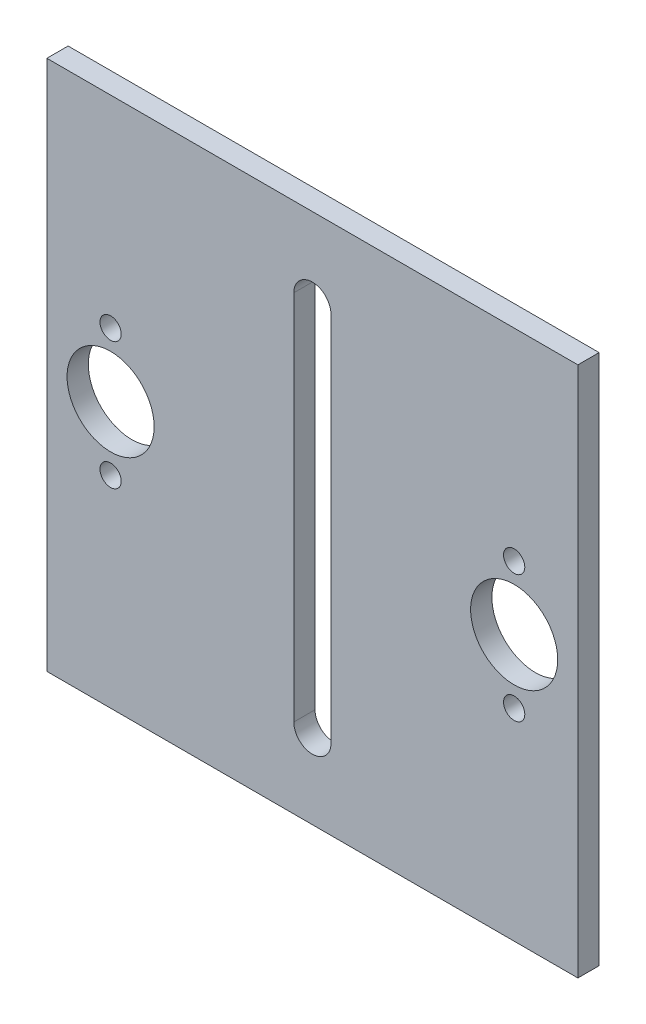
ISO-10303-21;
HEADER;
FILE_DESCRIPTION(('STEP AP214'),'2;1');
FILE_NAME('part.step','',(''),(''),'','','');
FILE_SCHEMA(('AUTOMOTIVE_DESIGN { 1 0 10303 214 1 1 1 1 }'));
ENDSEC;
DATA;
#1=APPLICATION_CONTEXT('core data for automotive mechanical design processes');
#2=APPLICATION_PROTOCOL_DEFINITION('international standard','automotive_design',2000,#1);
#3=PRODUCT_CONTEXT('',#1,'mechanical');
#4=PRODUCT('Part','Part','',(#3));
#5=PRODUCT_RELATED_PRODUCT_CATEGORY('part','',(#4));
#6=PRODUCT_DEFINITION_FORMATION('','',#4);
#7=PRODUCT_DEFINITION_CONTEXT('part definition',#1,'design');
#8=PRODUCT_DEFINITION('design','',#6,#7);
#9=PRODUCT_DEFINITION_SHAPE('','',#8);
#10=(LENGTH_UNIT() NAMED_UNIT(*) SI_UNIT(.MILLI.,.METRE.));
#11=(NAMED_UNIT(*) PLANE_ANGLE_UNIT() SI_UNIT($,.RADIAN.));
#12=(NAMED_UNIT(*) SI_UNIT($,.STERADIAN.) SOLID_ANGLE_UNIT());
#13=UNCERTAINTY_MEASURE_WITH_UNIT(LENGTH_MEASURE(1.E-05),#10,'distance_accuracy_value','');
#14=(GEOMETRIC_REPRESENTATION_CONTEXT(3) GLOBAL_UNCERTAINTY_ASSIGNED_CONTEXT((#13)) GLOBAL_UNIT_ASSIGNED_CONTEXT((#10,
#11,#12)) REPRESENTATION_CONTEXT('',''));
#15=CARTESIAN_POINT('',(0.,0.,0.));
#16=DIRECTION('',(0.,0.,1.));
#17=DIRECTION('',(1.,0.,0.));
#18=AXIS2_PLACEMENT_3D('',#15,#16,#17);
#19=CARTESIAN_POINT('',(0.,0.,2.));
#20=DIRECTION('',(1.,0.,0.));
#21=DIRECTION('',(0.,0.,-1.));
#22=AXIS2_PLACEMENT_3D('',#19,#20,#21);
#23=PLANE('',#22);
#24=DIRECTION('',(0.,-1.,0.));
#25=VECTOR('',#24,1.);
#26=CARTESIAN_POINT('',(0.,0.,0.));
#27=LINE('',#26,#25);
#28=CARTESIAN_POINT('',(0.,50.,0.));
#29=VERTEX_POINT('',#28);
#30=CARTESIAN_POINT('',(0.,0.,0.));
#31=VERTEX_POINT('',#30);
#32=EDGE_CURVE('E193',#29,#31,#27,.T.);
#33=ORIENTED_EDGE('',*,*,#32,.T.);
#34=DIRECTION('',(0.,0.,-1.));
#35=VECTOR('',#34,1.);
#36=CARTESIAN_POINT('',(0.,0.,2.));
#37=LINE('',#36,#35);
#38=CARTESIAN_POINT('',(0.,0.,2.));
#39=VERTEX_POINT('',#38);
#40=EDGE_CURVE('E11',#39,#31,#37,.T.);
#41=ORIENTED_EDGE('',*,*,#40,.F.);
#42=DIRECTION('',(0.,-1.,0.));
#43=VECTOR('',#42,1.);
#44=CARTESIAN_POINT('',(0.,0.,2.));
#45=LINE('',#44,#43);
#46=CARTESIAN_POINT('',(0.,50.,2.));
#47=VERTEX_POINT('',#46);
#48=EDGE_CURVE('E205',#47,#39,#45,.T.);
#49=ORIENTED_EDGE('',*,*,#48,.F.);
#50=DIRECTION('',(0.,0.,-1.));
#51=VECTOR('',#50,1.);
#52=CARTESIAN_POINT('',(0.,50.,2.));
#53=LINE('',#52,#51);
#54=EDGE_CURVE('E219',#47,#29,#53,.T.);
#55=ORIENTED_EDGE('',*,*,#54,.T.);
#56=EDGE_LOOP('',(#33,#41,#49,#55));
#57=FACE_BOUND('',#56,.T.);
#58=ADVANCED_FACE('F43',(#57),#23,.F.);
#59=CARTESIAN_POINT('',(0.,0.,2.));
#60=DIRECTION('',(0.,1.,0.));
#61=DIRECTION('',(0.,0.,1.));
#62=AXIS2_PLACEMENT_3D('',#59,#60,#61);
#63=PLANE('',#62);
#64=DIRECTION('',(1.,0.,0.));
#65=VECTOR('',#64,1.);
#66=CARTESIAN_POINT('',(0.,0.,0.));
#67=LINE('',#66,#65);
#68=CARTESIAN_POINT('',(50.,0.,0.));
#69=VERTEX_POINT('',#68);
#70=EDGE_CURVE('E223',#31,#69,#67,.T.);
#71=ORIENTED_EDGE('',*,*,#70,.T.);
#72=DIRECTION('',(0.,0.,-1.));
#73=VECTOR('',#72,1.);
#74=CARTESIAN_POINT('',(50.,0.,2.));
#75=LINE('',#74,#73);
#76=CARTESIAN_POINT('',(50.,0.,2.));
#77=VERTEX_POINT('',#76);
#78=EDGE_CURVE('E51',#77,#69,#75,.T.);
#79=ORIENTED_EDGE('',*,*,#78,.F.);
#80=DIRECTION('',(1.,0.,0.));
#81=VECTOR('',#80,1.);
#82=CARTESIAN_POINT('',(0.,0.,2.));
#83=LINE('',#82,#81);
#84=EDGE_CURVE('E209',#39,#77,#83,.T.);
#85=ORIENTED_EDGE('',*,*,#84,.F.);
#86=ORIENTED_EDGE('',*,*,#40,.T.);
#87=EDGE_LOOP('',(#71,#79,#85,#86));
#88=FACE_BOUND('',#87,.T.);
#89=ADVANCED_FACE('F258',(#88),#63,.F.);
#90=CARTESIAN_POINT('',(50.,0.,2.));
#91=DIRECTION('',(-1.,0.,0.));
#92=DIRECTION('',(0.,0.,1.));
#93=AXIS2_PLACEMENT_3D('',#90,#91,#92);
#94=PLANE('',#93);
#95=DIRECTION('',(0.,1.,0.));
#96=VECTOR('',#95,1.);
#97=CARTESIAN_POINT('',(50.,0.,0.));
#98=LINE('',#97,#96);
#99=CARTESIAN_POINT('',(50.,50.,0.));
#100=VERTEX_POINT('',#99);
#101=EDGE_CURVE('E226',#69,#100,#98,.T.);
#102=ORIENTED_EDGE('',*,*,#101,.T.);
#103=DIRECTION('',(0.,0.,-1.));
#104=VECTOR('',#103,1.);
#105=CARTESIAN_POINT('',(50.,50.,2.));
#106=LINE('',#105,#104);
#107=CARTESIAN_POINT('',(50.,50.,2.));
#108=VERTEX_POINT('',#107);
#109=EDGE_CURVE('E234',#108,#100,#106,.T.);
#110=ORIENTED_EDGE('',*,*,#109,.F.);
#111=DIRECTION('',(0.,1.,0.));
#112=VECTOR('',#111,1.);
#113=CARTESIAN_POINT('',(50.,0.,2.));
#114=LINE('',#113,#112);
#115=EDGE_CURVE('E213',#77,#108,#114,.T.);
#116=ORIENTED_EDGE('',*,*,#115,.F.);
#117=ORIENTED_EDGE('',*,*,#78,.T.);
#118=EDGE_LOOP('',(#102,#110,#116,#117));
#119=FACE_BOUND('',#118,.T.);
#120=ADVANCED_FACE('F243',(#119),#94,.F.);
#121=CARTESIAN_POINT('',(0.,50.,2.));
#122=DIRECTION('',(0.,-1.,0.));
#123=DIRECTION('',(0.,0.,-1.));
#124=AXIS2_PLACEMENT_3D('',#121,#122,#123);
#125=PLANE('',#124);
#126=DIRECTION('',(-1.,0.,0.));
#127=VECTOR('',#126,1.);
#128=CARTESIAN_POINT('',(0.,50.,0.));
#129=LINE('',#128,#127);
#130=EDGE_CURVE('E210',#100,#29,#129,.T.);
#131=ORIENTED_EDGE('',*,*,#130,.T.);
#132=ORIENTED_EDGE('',*,*,#54,.F.);
#133=DIRECTION('',(-1.,0.,0.));
#134=VECTOR('',#133,1.);
#135=CARTESIAN_POINT('',(0.,50.,2.));
#136=LINE('',#135,#134);
#137=EDGE_CURVE('E216',#108,#47,#136,.T.);
#138=ORIENTED_EDGE('',*,*,#137,.F.);
#139=ORIENTED_EDGE('',*,*,#109,.T.);
#140=EDGE_LOOP('',(#131,#132,#138,#139));
#141=FACE_BOUND('',#140,.T.);
#142=ADVANCED_FACE('F251',(#141),#125,.F.);
#143=CARTESIAN_POINT('',(0.,0.,2.));
#144=DIRECTION('',(0.,0.,-1.));
#145=DIRECTION('',(-1.,0.,0.));
#146=AXIS2_PLACEMENT_3D('',#143,#144,#145);
#147=PLANE('',#146);
#148=DIRECTION('',(0.,-1.,0.));
#149=VECTOR('',#148,1.);
#150=CARTESIAN_POINT('',(23.25,42.5,2.));
#151=LINE('',#150,#149);
#152=CARTESIAN_POINT('',(23.25,42.5,2.));
#153=VERTEX_POINT('',#152);
#154=CARTESIAN_POINT('',(23.25,7.50000000000001,2.));
#155=VERTEX_POINT('',#154);
#156=EDGE_CURVE('E142',#153,#155,#151,.T.);
#157=ORIENTED_EDGE('',*,*,#156,.F.);
#158=CARTESIAN_POINT('',(25.,42.5,2.));
#159=DIRECTION('',(0.,0.,1.));
#160=DIRECTION('',(1.,0.,0.));
#161=AXIS2_PLACEMENT_3D('',#158,#159,#160);
#162=CIRCLE('',#161,1.75);
#163=CARTESIAN_POINT('',(26.75,42.5,2.));
#164=VERTEX_POINT('',#163);
#165=EDGE_CURVE('E58',#164,#153,#162,.T.);
#166=ORIENTED_EDGE('',*,*,#165,.F.);
#167=DIRECTION('',(0.,1.,0.));
#168=VECTOR('',#167,1.);
#169=CARTESIAN_POINT('',(26.75,42.5,2.));
#170=LINE('',#169,#168);
#171=CARTESIAN_POINT('',(26.75,7.50000000000001,2.));
#172=VERTEX_POINT('',#171);
#173=EDGE_CURVE('E129',#172,#164,#170,.T.);
#174=ORIENTED_EDGE('',*,*,#173,.F.);
#175=CARTESIAN_POINT('',(25.,7.50000000000001,2.));
#176=DIRECTION('',(0.,0.,1.));
#177=DIRECTION('',(1.,0.,0.));
#178=AXIS2_PLACEMENT_3D('',#175,#176,#177);
#179=CIRCLE('',#178,1.75);
#180=EDGE_CURVE('E133',#155,#172,#179,.T.);
#181=ORIENTED_EDGE('',*,*,#180,.F.);
#182=EDGE_LOOP('',(#157,#166,#174,#181));
#183=FACE_BOUND('',#182,.T.);
#184=CARTESIAN_POINT('',(6.,19.,2.));
#185=DIRECTION('',(0.,0.,1.));
#186=DIRECTION('',(1.,0.,0.));
#187=AXIS2_PLACEMENT_3D('',#184,#185,#186);
#188=CIRCLE('',#187,1.);
#189=CARTESIAN_POINT('',(7.,19.,2.));
#190=VERTEX_POINT('',#189);
#191=EDGE_CURVE('E165',#190,#190,#188,.T.);
#192=ORIENTED_EDGE('',*,*,#191,.F.);
#193=EDGE_LOOP('',(#192));
#194=FACE_BOUND('',#193,.T.);
#195=CARTESIAN_POINT('',(44.,31.,2.));
#196=DIRECTION('',(0.,0.,1.));
#197=DIRECTION('',(1.,0.,0.));
#198=AXIS2_PLACEMENT_3D('',#195,#196,#197);
#199=CIRCLE('',#198,0.999999999999997);
#200=CARTESIAN_POINT('',(45.,31.,2.));
#201=VERTEX_POINT('',#200);
#202=EDGE_CURVE('E174',#201,#201,#199,.T.);
#203=ORIENTED_EDGE('',*,*,#202,.F.);
#204=EDGE_LOOP('',(#203));
#205=FACE_BOUND('',#204,.T.);
#206=CARTESIAN_POINT('',(44.,19.,2.));
#207=DIRECTION('',(0.,0.,1.));
#208=DIRECTION('',(1.,0.,0.));
#209=AXIS2_PLACEMENT_3D('',#206,#207,#208);
#210=CIRCLE('',#209,0.999999999999998);
#211=CARTESIAN_POINT('',(45.,19.,2.));
#212=VERTEX_POINT('',#211);
#213=EDGE_CURVE('E157',#212,#212,#210,.T.);
#214=ORIENTED_EDGE('',*,*,#213,.F.);
#215=EDGE_LOOP('',(#214));
#216=FACE_BOUND('',#215,.T.);
#217=CARTESIAN_POINT('',(6.,31.,2.));
#218=DIRECTION('',(0.,0.,1.));
#219=DIRECTION('',(1.,0.,0.));
#220=AXIS2_PLACEMENT_3D('',#217,#218,#219);
#221=CIRCLE('',#220,1.);
#222=CARTESIAN_POINT('',(7.,31.,2.));
#223=VERTEX_POINT('',#222);
#224=EDGE_CURVE('E169',#223,#223,#221,.T.);
#225=ORIENTED_EDGE('',*,*,#224,.F.);
#226=EDGE_LOOP('',(#225));
#227=FACE_BOUND('',#226,.T.);
#228=CARTESIAN_POINT('',(6.,25.,2.));
#229=DIRECTION('',(0.,0.,1.));
#230=DIRECTION('',(1.,0.,0.));
#231=AXIS2_PLACEMENT_3D('',#228,#229,#230);
#232=CIRCLE('',#231,4.1);
#233=CARTESIAN_POINT('',(10.1,25.,2.));
#234=VERTEX_POINT('',#233);
#235=EDGE_CURVE('E194',#234,#234,#232,.T.);
#236=ORIENTED_EDGE('',*,*,#235,.F.);
#237=EDGE_LOOP('',(#236));
#238=FACE_BOUND('',#237,.T.);
#239=CARTESIAN_POINT('',(44.,25.,2.));
#240=DIRECTION('',(0.,0.,1.));
#241=DIRECTION('',(1.,0.,0.));
#242=AXIS2_PLACEMENT_3D('',#239,#240,#241);
#243=CIRCLE('',#242,4.1);
#244=CARTESIAN_POINT('',(48.1,25.,2.));
#245=VERTEX_POINT('',#244);
#246=EDGE_CURVE('E198',#245,#245,#243,.T.);
#247=ORIENTED_EDGE('',*,*,#246,.F.);
#248=EDGE_LOOP('',(#247));
#249=FACE_BOUND('',#248,.T.);
#250=ORIENTED_EDGE('',*,*,#48,.T.);
#251=ORIENTED_EDGE('',*,*,#84,.T.);
#252=ORIENTED_EDGE('',*,*,#115,.T.);
#253=ORIENTED_EDGE('',*,*,#137,.T.);
#254=EDGE_LOOP('',(#250,#251,#252,#253));
#255=FACE_BOUND('',#254,.T.);
#256=ADVANCED_FACE('F257',(#183,#194,#205,#216,#227,#238,#249,#255),#147,.F.);
#257=CARTESIAN_POINT('',(0.,0.,0.));
#258=DIRECTION('',(0.,0.,-1.));
#259=DIRECTION('',(-1.,0.,0.));
#260=AXIS2_PLACEMENT_3D('',#257,#258,#259);
#261=PLANE('',#260);
#262=CARTESIAN_POINT('',(25.,42.5,0.));
#263=DIRECTION('',(0.,0.,1.));
#264=DIRECTION('',(1.,0.,0.));
#265=AXIS2_PLACEMENT_3D('',#262,#263,#264);
#266=CIRCLE('',#265,1.75);
#267=CARTESIAN_POINT('',(26.75,42.5,0.));
#268=VERTEX_POINT('',#267);
#269=CARTESIAN_POINT('',(23.25,42.5,0.));
#270=VERTEX_POINT('',#269);
#271=EDGE_CURVE('E110',#268,#270,#266,.T.);
#272=ORIENTED_EDGE('',*,*,#271,.T.);
#273=DIRECTION('',(0.,-1.,0.));
#274=VECTOR('',#273,1.);
#275=CARTESIAN_POINT('',(23.25,42.5,0.));
#276=LINE('',#275,#274);
#277=CARTESIAN_POINT('',(23.25,7.50000000000001,0.));
#278=VERTEX_POINT('',#277);
#279=EDGE_CURVE('E120',#270,#278,#276,.T.);
#280=ORIENTED_EDGE('',*,*,#279,.T.);
#281=CARTESIAN_POINT('',(25.,7.50000000000001,0.));
#282=DIRECTION('',(0.,0.,1.));
#283=DIRECTION('',(1.,0.,0.));
#284=AXIS2_PLACEMENT_3D('',#281,#282,#283);
#285=CIRCLE('',#284,1.75);
#286=CARTESIAN_POINT('',(26.75,7.50000000000001,0.));
#287=VERTEX_POINT('',#286);
#288=EDGE_CURVE('E66',#278,#287,#285,.T.);
#289=ORIENTED_EDGE('',*,*,#288,.T.);
#290=DIRECTION('',(0.,1.,0.));
#291=VECTOR('',#290,1.);
#292=CARTESIAN_POINT('',(26.75,42.5,0.));
#293=LINE('',#292,#291);
#294=EDGE_CURVE('E117',#287,#268,#293,.T.);
#295=ORIENTED_EDGE('',*,*,#294,.T.);
#296=EDGE_LOOP('',(#272,#280,#289,#295));
#297=FACE_BOUND('',#296,.T.);
#298=CARTESIAN_POINT('',(6.,19.,0.));
#299=DIRECTION('',(0.,0.,1.));
#300=DIRECTION('',(1.,0.,0.));
#301=AXIS2_PLACEMENT_3D('',#298,#299,#300);
#302=CIRCLE('',#301,1.);
#303=CARTESIAN_POINT('',(7.,19.,0.));
#304=VERTEX_POINT('',#303);
#305=EDGE_CURVE('E170',#304,#304,#302,.T.);
#306=ORIENTED_EDGE('',*,*,#305,.T.);
#307=EDGE_LOOP('',(#306));
#308=FACE_BOUND('',#307,.T.);
#309=CARTESIAN_POINT('',(44.,31.,0.));
#310=DIRECTION('',(0.,0.,1.));
#311=DIRECTION('',(1.,0.,0.));
#312=AXIS2_PLACEMENT_3D('',#309,#310,#311);
#313=CIRCLE('',#312,0.999999999999997);
#314=CARTESIAN_POINT('',(45.,31.,0.));
#315=VERTEX_POINT('',#314);
#316=EDGE_CURVE('E161',#315,#315,#313,.T.);
#317=ORIENTED_EDGE('',*,*,#316,.T.);
#318=EDGE_LOOP('',(#317));
#319=FACE_BOUND('',#318,.T.);
#320=CARTESIAN_POINT('',(44.,19.,0.));
#321=DIRECTION('',(0.,0.,1.));
#322=DIRECTION('',(1.,0.,0.));
#323=AXIS2_PLACEMENT_3D('',#320,#321,#322);
#324=CIRCLE('',#323,0.999999999999998);
#325=CARTESIAN_POINT('',(45.,19.,0.));
#326=VERTEX_POINT('',#325);
#327=EDGE_CURVE('E151',#326,#326,#324,.T.);
#328=ORIENTED_EDGE('',*,*,#327,.T.);
#329=EDGE_LOOP('',(#328));
#330=FACE_BOUND('',#329,.T.);
#331=CARTESIAN_POINT('',(6.,31.,0.));
#332=DIRECTION('',(0.,0.,1.));
#333=DIRECTION('',(1.,0.,0.));
#334=AXIS2_PLACEMENT_3D('',#331,#332,#333);
#335=CIRCLE('',#334,1.);
#336=CARTESIAN_POINT('',(7.,31.,0.));
#337=VERTEX_POINT('',#336);
#338=EDGE_CURVE('E181',#337,#337,#335,.T.);
#339=ORIENTED_EDGE('',*,*,#338,.T.);
#340=EDGE_LOOP('',(#339));
#341=FACE_BOUND('',#340,.T.);
#342=CARTESIAN_POINT('',(6.,25.,0.));
#343=DIRECTION('',(0.,0.,1.));
#344=DIRECTION('',(1.,0.,0.));
#345=AXIS2_PLACEMENT_3D('',#342,#343,#344);
#346=CIRCLE('',#345,4.1);
#347=CARTESIAN_POINT('',(10.1,25.,0.));
#348=VERTEX_POINT('',#347);
#349=EDGE_CURVE('E189',#348,#348,#346,.T.);
#350=ORIENTED_EDGE('',*,*,#349,.T.);
#351=EDGE_LOOP('',(#350));
#352=FACE_BOUND('',#351,.T.);
#353=CARTESIAN_POINT('',(44.,25.,0.));
#354=DIRECTION('',(0.,0.,1.));
#355=DIRECTION('',(1.,0.,0.));
#356=AXIS2_PLACEMENT_3D('',#353,#354,#355);
#357=CIRCLE('',#356,4.1);
#358=CARTESIAN_POINT('',(48.1,25.,0.));
#359=VERTEX_POINT('',#358);
#360=EDGE_CURVE('E185',#359,#359,#357,.T.);
#361=ORIENTED_EDGE('',*,*,#360,.T.);
#362=EDGE_LOOP('',(#361));
#363=FACE_BOUND('',#362,.T.);
#364=ORIENTED_EDGE('',*,*,#32,.F.);
#365=ORIENTED_EDGE('',*,*,#130,.F.);
#366=ORIENTED_EDGE('',*,*,#101,.F.);
#367=ORIENTED_EDGE('',*,*,#70,.F.);
#368=EDGE_LOOP('',(#364,#365,#366,#367));
#369=FACE_BOUND('',#368,.T.);
#370=ADVANCED_FACE('F125',(#297,#308,#319,#330,#341,#352,#363,#369),#261,.T.);
#371=CARTESIAN_POINT('',(44.,25.,0.));
#372=DIRECTION('',(0.,0.,1.));
#373=DIRECTION('',(1.,0.,0.));
#374=AXIS2_PLACEMENT_3D('',#371,#372,#373);
#375=CYLINDRICAL_SURFACE('',#374,4.1);
#376=ORIENTED_EDGE('',*,*,#360,.F.);
#377=EDGE_LOOP('',(#376));
#378=FACE_BOUND('',#377,.T.);
#379=ORIENTED_EDGE('',*,*,#246,.T.);
#380=EDGE_LOOP('',(#379));
#381=FACE_BOUND('',#380,.T.);
#382=ADVANCED_FACE('F270',(#378,#381),#375,.F.);
#383=CARTESIAN_POINT('',(6.,25.,0.));
#384=DIRECTION('',(0.,0.,1.));
#385=DIRECTION('',(1.,0.,0.));
#386=AXIS2_PLACEMENT_3D('',#383,#384,#385);
#387=CYLINDRICAL_SURFACE('',#386,4.1);
#388=ORIENTED_EDGE('',*,*,#349,.F.);
#389=EDGE_LOOP('',(#388));
#390=FACE_BOUND('',#389,.T.);
#391=ORIENTED_EDGE('',*,*,#235,.T.);
#392=EDGE_LOOP('',(#391));
#393=FACE_BOUND('',#392,.T.);
#394=ADVANCED_FACE('F276',(#390,#393),#387,.F.);
#395=CARTESIAN_POINT('',(6.,31.,0.));
#396=DIRECTION('',(0.,0.,1.));
#397=DIRECTION('',(1.,0.,0.));
#398=AXIS2_PLACEMENT_3D('',#395,#396,#397);
#399=CYLINDRICAL_SURFACE('',#398,1.);
#400=ORIENTED_EDGE('',*,*,#338,.F.);
#401=EDGE_LOOP('',(#400));
#402=FACE_BOUND('',#401,.T.);
#403=ORIENTED_EDGE('',*,*,#224,.T.);
#404=EDGE_LOOP('',(#403));
#405=FACE_BOUND('',#404,.T.);
#406=ADVANCED_FACE('F280',(#402,#405),#399,.F.);
#407=CARTESIAN_POINT('',(44.,19.,0.));
#408=DIRECTION('',(0.,0.,1.));
#409=DIRECTION('',(1.,0.,0.));
#410=AXIS2_PLACEMENT_3D('',#407,#408,#409);
#411=CYLINDRICAL_SURFACE('',#410,0.999999999999998);
#412=ORIENTED_EDGE('',*,*,#327,.F.);
#413=EDGE_LOOP('',(#412));
#414=FACE_BOUND('',#413,.T.);
#415=ORIENTED_EDGE('',*,*,#213,.T.);
#416=EDGE_LOOP('',(#415));
#417=FACE_BOUND('',#416,.T.);
#418=ADVANCED_FACE('F284',(#414,#417),#411,.F.);
#419=CARTESIAN_POINT('',(44.,31.,0.));
#420=DIRECTION('',(0.,0.,1.));
#421=DIRECTION('',(1.,0.,0.));
#422=AXIS2_PLACEMENT_3D('',#419,#420,#421);
#423=CYLINDRICAL_SURFACE('',#422,0.999999999999997);
#424=ORIENTED_EDGE('',*,*,#316,.F.);
#425=EDGE_LOOP('',(#424));
#426=FACE_BOUND('',#425,.T.);
#427=ORIENTED_EDGE('',*,*,#202,.T.);
#428=EDGE_LOOP('',(#427));
#429=FACE_BOUND('',#428,.T.);
#430=ADVANCED_FACE('F286',(#426,#429),#423,.F.);
#431=CARTESIAN_POINT('',(6.,19.,0.));
#432=DIRECTION('',(0.,0.,1.));
#433=DIRECTION('',(1.,0.,0.));
#434=AXIS2_PLACEMENT_3D('',#431,#432,#433);
#435=CYLINDRICAL_SURFACE('',#434,1.);
#436=ORIENTED_EDGE('',*,*,#305,.F.);
#437=EDGE_LOOP('',(#436));
#438=FACE_BOUND('',#437,.T.);
#439=ORIENTED_EDGE('',*,*,#191,.T.);
#440=EDGE_LOOP('',(#439));
#441=FACE_BOUND('',#440,.T.);
#442=ADVANCED_FACE('F289',(#438,#441),#435,.F.);
#443=CARTESIAN_POINT('',(25.,42.5,0.));
#444=DIRECTION('',(0.,0.,1.));
#445=DIRECTION('',(1.,0.,0.));
#446=AXIS2_PLACEMENT_3D('',#443,#444,#445);
#447=CYLINDRICAL_SURFACE('',#446,1.75);
#448=ORIENTED_EDGE('',*,*,#165,.T.);
#449=DIRECTION('',(0.,0.,1.));
#450=VECTOR('',#449,1.);
#451=CARTESIAN_POINT('',(23.25,42.5,0.));
#452=LINE('',#451,#450);
#453=EDGE_CURVE('E106',#270,#153,#452,.T.);
#454=ORIENTED_EDGE('',*,*,#453,.F.);
#455=ORIENTED_EDGE('',*,*,#271,.F.);
#456=DIRECTION('',(0.,0.,1.));
#457=VECTOR('',#456,1.);
#458=CARTESIAN_POINT('',(26.75,42.5,0.));
#459=LINE('',#458,#457);
#460=EDGE_CURVE('E148',#268,#164,#459,.T.);
#461=ORIENTED_EDGE('',*,*,#460,.T.);
#462=EDGE_LOOP('',(#448,#454,#455,#461));
#463=FACE_BOUND('',#462,.T.);
#464=ADVANCED_FACE('F108',(#463),#447,.F.);
#465=CARTESIAN_POINT('',(26.75,42.5,0.));
#466=DIRECTION('',(1.,0.,0.));
#467=DIRECTION('',(0.,1.,0.));
#468=AXIS2_PLACEMENT_3D('',#465,#466,#467);
#469=PLANE('',#468);
#470=ORIENTED_EDGE('',*,*,#173,.T.);
#471=ORIENTED_EDGE('',*,*,#460,.F.);
#472=ORIENTED_EDGE('',*,*,#294,.F.);
#473=DIRECTION('',(0.,0.,1.));
#474=VECTOR('',#473,1.);
#475=CARTESIAN_POINT('',(26.75,7.50000000000001,0.));
#476=LINE('',#475,#474);
#477=EDGE_CURVE('E152',#287,#172,#476,.T.);
#478=ORIENTED_EDGE('',*,*,#477,.T.);
#479=EDGE_LOOP('',(#470,#471,#472,#478));
#480=FACE_BOUND('',#479,.T.);
#481=ADVANCED_FACE('F299',(#480),#469,.F.);
#482=CARTESIAN_POINT('',(25.,7.50000000000001,0.));
#483=DIRECTION('',(0.,0.,1.));
#484=DIRECTION('',(1.,0.,0.));
#485=AXIS2_PLACEMENT_3D('',#482,#483,#484);
#486=CYLINDRICAL_SURFACE('',#485,1.75);
#487=ORIENTED_EDGE('',*,*,#180,.T.);
#488=ORIENTED_EDGE('',*,*,#477,.F.);
#489=ORIENTED_EDGE('',*,*,#288,.F.);
#490=DIRECTION('',(0.,0.,1.));
#491=VECTOR('',#490,1.);
#492=CARTESIAN_POINT('',(23.25,7.50000000000001,0.));
#493=LINE('',#492,#491);
#494=EDGE_CURVE('E116',#278,#155,#493,.T.);
#495=ORIENTED_EDGE('',*,*,#494,.T.);
#496=EDGE_LOOP('',(#487,#488,#489,#495));
#497=FACE_BOUND('',#496,.T.);
#498=ADVANCED_FACE('F302',(#497),#486,.F.);
#499=CARTESIAN_POINT('',(23.25,42.5,0.));
#500=DIRECTION('',(-1.,0.,0.));
#501=DIRECTION('',(0.,-1.,0.));
#502=AXIS2_PLACEMENT_3D('',#499,#500,#501);
#503=PLANE('',#502);
#504=ORIENTED_EDGE('',*,*,#156,.T.);
#505=ORIENTED_EDGE('',*,*,#494,.F.);
#506=ORIENTED_EDGE('',*,*,#279,.F.);
#507=ORIENTED_EDGE('',*,*,#453,.T.);
#508=EDGE_LOOP('',(#504,#505,#506,#507));
#509=FACE_BOUND('',#508,.T.);
#510=ADVANCED_FACE('F121',(#509),#503,.F.);
#511=CLOSED_SHELL('',(#58,#89,#120,#142,#256,#370,#382,#394,#406,#418,#430,#442,#464,#481,#498,#510));
#512=MANIFOLD_SOLID_BREP('B2',#511);
#513=ADVANCED_BREP_SHAPE_REPRESENTATION('',(#18,#512),#14);
#514=SHAPE_DEFINITION_REPRESENTATION(#9,#513);
ENDSEC;
END-ISO-10303-21;
